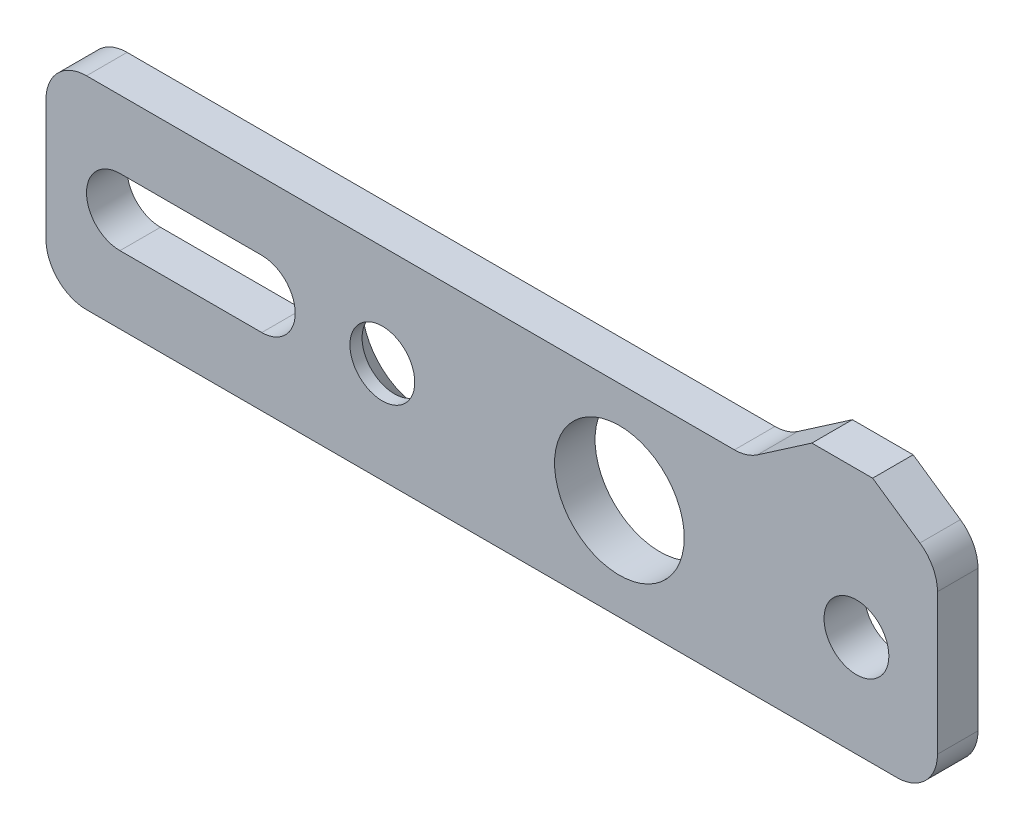
ISO-10303-21;
HEADER;
FILE_DESCRIPTION(('STEP AP214'),'2;1');
FILE_NAME('part.step','',(''),(''),'','','');
FILE_SCHEMA(('AUTOMOTIVE_DESIGN { 1 0 10303 214 1 1 1 1 }'));
ENDSEC;
DATA;
#1=APPLICATION_CONTEXT('core data for automotive mechanical design processes');
#2=APPLICATION_PROTOCOL_DEFINITION('international standard','automotive_design',2000,#1);
#3=PRODUCT_CONTEXT('',#1,'mechanical');
#4=PRODUCT('Part','Part','',(#3));
#5=PRODUCT_RELATED_PRODUCT_CATEGORY('part','',(#4));
#6=PRODUCT_DEFINITION_FORMATION('','',#4);
#7=PRODUCT_DEFINITION_CONTEXT('part definition',#1,'design');
#8=PRODUCT_DEFINITION('design','',#6,#7);
#9=PRODUCT_DEFINITION_SHAPE('','',#8);
#10=(LENGTH_UNIT() NAMED_UNIT(*) SI_UNIT(.MILLI.,.METRE.));
#11=(NAMED_UNIT(*) PLANE_ANGLE_UNIT() SI_UNIT($,.RADIAN.));
#12=(NAMED_UNIT(*) SI_UNIT($,.STERADIAN.) SOLID_ANGLE_UNIT());
#13=UNCERTAINTY_MEASURE_WITH_UNIT(LENGTH_MEASURE(1.E-05),#10,'distance_accuracy_value','');
#14=(GEOMETRIC_REPRESENTATION_CONTEXT(3) GLOBAL_UNCERTAINTY_ASSIGNED_CONTEXT((#13)) GLOBAL_UNIT_ASSIGNED_CONTEXT((#10,
#11,#12)) REPRESENTATION_CONTEXT('',''));
#15=CARTESIAN_POINT('',(0.,0.,0.));
#16=DIRECTION('',(0.,0.,1.));
#17=DIRECTION('',(1.,0.,0.));
#18=AXIS2_PLACEMENT_3D('',#15,#16,#17);
#19=CARTESIAN_POINT('',(62.9999999999999,25.,-10.));
#20=DIRECTION('',(0.,1.,0.));
#21=DIRECTION('',(-1.,0.,0.));
#22=AXIS2_PLACEMENT_3D('',#19,#20,#21);
#23=PLANE('',#22);
#24=DIRECTION('',(-1.,0.,0.));
#25=VECTOR('',#24,1.);
#26=CARTESIAN_POINT('',(62.9999999999999,25.,0.));
#27=LINE('',#26,#25);
#28=CARTESIAN_POINT('',(59.894101964593,25.,0.));
#29=VERTEX_POINT('',#28);
#30=CARTESIAN_POINT('',(-100.,25.,0.));
#31=VERTEX_POINT('',#30);
#32=EDGE_CURVE('E212',#29,#31,#27,.T.);
#33=ORIENTED_EDGE('',*,*,#32,.F.);
#34=DIRECTION('',(0.,0.,1.));
#35=VECTOR('',#34,1.);
#36=CARTESIAN_POINT('',(59.894101964593,25.,-10.));
#37=LINE('',#36,#35);
#38=CARTESIAN_POINT('',(59.894101964593,25.,-10.));
#39=VERTEX_POINT('',#38);
#40=EDGE_CURVE('E293',#29,#39,#37,.F.);
#41=ORIENTED_EDGE('',*,*,#40,.T.);
#42=DIRECTION('',(-1.,0.,0.));
#43=VECTOR('',#42,1.);
#44=CARTESIAN_POINT('',(62.9999999999999,25.,-10.));
#45=LINE('',#44,#43);
#46=CARTESIAN_POINT('',(-100.,25.,-10.));
#47=VERTEX_POINT('',#46);
#48=EDGE_CURVE('E218',#39,#47,#45,.T.);
#49=ORIENTED_EDGE('',*,*,#48,.T.);
#50=DIRECTION('',(0.,0.,1.));
#51=VECTOR('',#50,1.);
#52=CARTESIAN_POINT('',(-100.,25.,-10.));
#53=LINE('',#52,#51);
#54=EDGE_CURVE('E289',#47,#31,#53,.T.);
#55=ORIENTED_EDGE('',*,*,#54,.T.);
#56=EDGE_LOOP('',(#33,#41,#49,#55));
#57=FACE_BOUND('',#56,.T.);
#58=ADVANCED_FACE('F44',(#57),#23,.T.);
#59=CARTESIAN_POINT('',(78.9999999999999,36.0000000000001,-10.));
#60=DIRECTION('',(-0.566528822887066,0.824041924199367,0.));
#61=DIRECTION('',(-0.824041924199367,-0.566528822887066,0.));
#62=AXIS2_PLACEMENT_3D('',#59,#60,#61);
#63=PLANE('',#62);
#64=DIRECTION('',(-0.824041924199367,-0.566528822887066,0.));
#65=VECTOR('',#64,1.);
#66=CARTESIAN_POINT('',(78.9999999999999,36.0000000000001,-10.));
#67=LINE('',#66,#65);
#68=CARTESIAN_POINT('',(78.9999999999999,36.0000000000001,-10.));
#69=VERTEX_POINT('',#68);
#70=CARTESIAN_POINT('',(65.5593901934637,26.7595807580064,-10.));
#71=VERTEX_POINT('',#70);
#72=EDGE_CURVE('E241',#69,#71,#67,.T.);
#73=ORIENTED_EDGE('',*,*,#72,.T.);
#74=DIRECTION('',(0.,0.,1.));
#75=VECTOR('',#74,1.);
#76=CARTESIAN_POINT('',(65.5593901934637,26.7595807580064,0.));
#77=LINE('',#76,#75);
#78=CARTESIAN_POINT('',(65.5593901934637,26.7595807580064,0.));
#79=VERTEX_POINT('',#78);
#80=EDGE_CURVE('E285',#71,#79,#77,.T.);
#81=ORIENTED_EDGE('',*,*,#80,.T.);
#82=DIRECTION('',(-0.824041924199367,-0.566528822887066,0.));
#83=VECTOR('',#82,1.);
#84=CARTESIAN_POINT('',(78.9999999999999,36.0000000000001,0.));
#85=LINE('',#84,#83);
#86=CARTESIAN_POINT('',(78.9999999999999,36.0000000000001,0.));
#87=VERTEX_POINT('',#86);
#88=EDGE_CURVE('E223',#87,#79,#85,.T.);
#89=ORIENTED_EDGE('',*,*,#88,.F.);
#90=DIRECTION('',(0.,0.,1.));
#91=VECTOR('',#90,1.);
#92=CARTESIAN_POINT('',(78.9999999999999,36.0000000000001,-10.));
#93=LINE('',#92,#91);
#94=EDGE_CURVE('E271',#69,#87,#93,.T.);
#95=ORIENTED_EDGE('',*,*,#94,.F.);
#96=EDGE_LOOP('',(#73,#81,#89,#95));
#97=FACE_BOUND('',#96,.T.);
#98=ADVANCED_FACE('F360',(#97),#63,.T.);
#99=CARTESIAN_POINT('',(93.9999999999999,36.,-10.));
#100=DIRECTION('',(0.,1.,0.));
#101=DIRECTION('',(-1.,0.,0.));
#102=AXIS2_PLACEMENT_3D('',#99,#100,#101);
#103=PLANE('',#102);
#104=DIRECTION('',(-1.,0.,0.));
#105=VECTOR('',#104,1.);
#106=CARTESIAN_POINT('',(93.9999999999999,36.,0.));
#107=LINE('',#106,#105);
#108=CARTESIAN_POINT('',(93.9999999999999,36.,0.));
#109=VERTEX_POINT('',#108);
#110=EDGE_CURVE('E264',#109,#87,#107,.T.);
#111=ORIENTED_EDGE('',*,*,#110,.F.);
#112=DIRECTION('',(0.,0.,1.));
#113=VECTOR('',#112,1.);
#114=CARTESIAN_POINT('',(93.9999999999999,36.,-10.));
#115=LINE('',#114,#113);
#116=CARTESIAN_POINT('',(93.9999999999999,36.,-10.));
#117=VERTEX_POINT('',#116);
#118=EDGE_CURVE('E245',#117,#109,#115,.T.);
#119=ORIENTED_EDGE('',*,*,#118,.F.);
#120=DIRECTION('',(-1.,0.,0.));
#121=VECTOR('',#120,1.);
#122=CARTESIAN_POINT('',(93.9999999999999,36.,-10.));
#123=LINE('',#122,#121);
#124=EDGE_CURVE('E237',#117,#69,#123,.T.);
#125=ORIENTED_EDGE('',*,*,#124,.T.);
#126=ORIENTED_EDGE('',*,*,#94,.T.);
#127=EDGE_LOOP('',(#111,#119,#125,#126));
#128=FACE_BOUND('',#127,.T.);
#129=ADVANCED_FACE('F364',(#128),#103,.T.);
#130=CARTESIAN_POINT('',(110.,25.0000000000001,-10.));
#131=DIRECTION('',(0.566528822887065,0.824041924199368,0.));
#132=DIRECTION('',(-0.824041924199368,0.566528822887065,0.));
#133=AXIS2_PLACEMENT_3D('',#130,#131,#132);
#134=PLANE('',#133);
#135=DIRECTION('',(-0.824041924199368,0.566528822887065,0.));
#136=VECTOR('',#135,1.);
#137=CARTESIAN_POINT('',(110.,25.0000000000001,0.));
#138=LINE('',#137,#136);
#139=CARTESIAN_POINT('',(105.665288228871,27.9801143426515,0.));
#140=VERTEX_POINT('',#139);
#141=EDGE_CURVE('E261',#140,#109,#138,.T.);
#142=ORIENTED_EDGE('',*,*,#141,.F.);
#143=DIRECTION('',(0.,0.,1.));
#144=VECTOR('',#143,1.);
#145=CARTESIAN_POINT('',(105.665288228871,27.9801143426515,-10.));
#146=LINE('',#145,#144);
#147=CARTESIAN_POINT('',(105.665288228871,27.9801143426515,-10.));
#148=VERTEX_POINT('',#147);
#149=EDGE_CURVE('E315',#140,#148,#146,.F.);
#150=ORIENTED_EDGE('',*,*,#149,.T.);
#151=DIRECTION('',(-0.824041924199368,0.566528822887065,0.));
#152=VECTOR('',#151,1.);
#153=CARTESIAN_POINT('',(110.,25.0000000000001,-10.));
#154=LINE('',#153,#152);
#155=EDGE_CURVE('E234',#148,#117,#154,.T.);
#156=ORIENTED_EDGE('',*,*,#155,.T.);
#157=ORIENTED_EDGE('',*,*,#118,.T.);
#158=EDGE_LOOP('',(#142,#150,#156,#157));
#159=FACE_BOUND('',#158,.T.);
#160=ADVANCED_FACE('F584',(#159),#134,.T.);
#161=CARTESIAN_POINT('',(110.,-25.,-10.));
#162=DIRECTION('',(1.,0.,0.));
#163=DIRECTION('',(0.,1.,0.));
#164=AXIS2_PLACEMENT_3D('',#161,#162,#163);
#165=PLANE('',#164);
#166=DIRECTION('',(0.,1.,0.));
#167=VECTOR('',#166,1.);
#168=CARTESIAN_POINT('',(110.,-25.,-10.));
#169=LINE('',#168,#167);
#170=CARTESIAN_POINT('',(110.,-15.,-10.));
#171=VERTEX_POINT('',#170);
#172=CARTESIAN_POINT('',(110.,19.7396951006578,-10.));
#173=VERTEX_POINT('',#172);
#174=EDGE_CURVE('E230',#171,#173,#169,.T.);
#175=ORIENTED_EDGE('',*,*,#174,.T.);
#176=DIRECTION('',(0.,0.,1.));
#177=VECTOR('',#176,1.);
#178=CARTESIAN_POINT('',(110.,19.7396951006578,-10.));
#179=LINE('',#178,#177);
#180=CARTESIAN_POINT('',(110.,19.7396951006578,0.));
#181=VERTEX_POINT('',#180);
#182=EDGE_CURVE('E299',#173,#181,#179,.T.);
#183=ORIENTED_EDGE('',*,*,#182,.T.);
#184=DIRECTION('',(0.,1.,0.));
#185=VECTOR('',#184,1.);
#186=CARTESIAN_POINT('',(110.,-25.,0.));
#187=LINE('',#186,#185);
#188=CARTESIAN_POINT('',(110.,-15.,0.));
#189=VERTEX_POINT('',#188);
#190=EDGE_CURVE('E257',#189,#181,#187,.T.);
#191=ORIENTED_EDGE('',*,*,#190,.F.);
#192=DIRECTION('',(0.,0.,1.));
#193=VECTOR('',#192,1.);
#194=CARTESIAN_POINT('',(110.,-15.,-10.));
#195=LINE('',#194,#193);
#196=EDGE_CURVE('E296',#189,#171,#195,.F.);
#197=ORIENTED_EDGE('',*,*,#196,.T.);
#198=EDGE_LOOP('',(#175,#183,#191,#197));
#199=FACE_BOUND('',#198,.T.);
#200=ADVANCED_FACE('F374',(#199),#165,.T.);
#201=CARTESIAN_POINT('',(110.,-25.,-10.));
#202=DIRECTION('',(0.,-1.,0.));
#203=DIRECTION('',(1.,0.,0.));
#204=AXIS2_PLACEMENT_3D('',#201,#202,#203);
#205=PLANE('',#204);
#206=DIRECTION('',(1.,0.,0.));
#207=VECTOR('',#206,1.);
#208=CARTESIAN_POINT('',(110.,-25.,-10.));
#209=LINE('',#208,#207);
#210=CARTESIAN_POINT('',(-100.,-25.,-10.));
#211=VERTEX_POINT('',#210);
#212=CARTESIAN_POINT('',(99.9999999999999,-25.,-10.));
#213=VERTEX_POINT('',#212);
#214=EDGE_CURVE('E226',#211,#213,#209,.T.);
#215=ORIENTED_EDGE('',*,*,#214,.T.);
#216=DIRECTION('',(0.,0.,1.));
#217=VECTOR('',#216,1.);
#218=CARTESIAN_POINT('',(99.9999999999999,-25.,-10.));
#219=LINE('',#218,#217);
#220=CARTESIAN_POINT('',(99.9999999999999,-25.,0.));
#221=VERTEX_POINT('',#220);
#222=EDGE_CURVE('E332',#213,#221,#219,.T.);
#223=ORIENTED_EDGE('',*,*,#222,.T.);
#224=DIRECTION('',(1.,0.,0.));
#225=VECTOR('',#224,1.);
#226=CARTESIAN_POINT('',(110.,-25.,0.));
#227=LINE('',#226,#225);
#228=CARTESIAN_POINT('',(-100.,-25.,0.));
#229=VERTEX_POINT('',#228);
#230=EDGE_CURVE('E253',#229,#221,#227,.T.);
#231=ORIENTED_EDGE('',*,*,#230,.F.);
#232=DIRECTION('',(0.,0.,1.));
#233=VECTOR('',#232,1.);
#234=CARTESIAN_POINT('',(-100.,-25.,-10.));
#235=LINE('',#234,#233);
#236=EDGE_CURVE('E329',#229,#211,#235,.F.);
#237=ORIENTED_EDGE('',*,*,#236,.T.);
#238=EDGE_LOOP('',(#215,#223,#231,#237));
#239=FACE_BOUND('',#238,.T.);
#240=ADVANCED_FACE('F383',(#239),#205,.T.);
#241=CARTESIAN_POINT('',(-110.,-25.,-10.));
#242=DIRECTION('',(-1.,0.,0.));
#243=DIRECTION('',(0.,-1.,0.));
#244=AXIS2_PLACEMENT_3D('',#241,#242,#243);
#245=PLANE('',#244);
#246=DIRECTION('',(0.,-1.,0.));
#247=VECTOR('',#246,1.);
#248=CARTESIAN_POINT('',(-110.,-25.,-10.));
#249=LINE('',#248,#247);
#250=CARTESIAN_POINT('',(-110.,15.,-10.));
#251=VERTEX_POINT('',#250);
#252=CARTESIAN_POINT('',(-110.,-15.,-10.));
#253=VERTEX_POINT('',#252);
#254=EDGE_CURVE('E222',#251,#253,#249,.T.);
#255=ORIENTED_EDGE('',*,*,#254,.T.);
#256=DIRECTION('',(0.,0.,1.));
#257=VECTOR('',#256,1.);
#258=CARTESIAN_POINT('',(-110.,-15.,-10.));
#259=LINE('',#258,#257);
#260=CARTESIAN_POINT('',(-110.,-15.,0.));
#261=VERTEX_POINT('',#260);
#262=EDGE_CURVE('E338',#253,#261,#259,.T.);
#263=ORIENTED_EDGE('',*,*,#262,.T.);
#264=DIRECTION('',(0.,-1.,0.));
#265=VECTOR('',#264,1.);
#266=CARTESIAN_POINT('',(-110.,-25.,0.));
#267=LINE('',#266,#265);
#268=CARTESIAN_POINT('',(-110.,15.,0.));
#269=VERTEX_POINT('',#268);
#270=EDGE_CURVE('E249',#269,#261,#267,.T.);
#271=ORIENTED_EDGE('',*,*,#270,.F.);
#272=DIRECTION('',(0.,0.,1.));
#273=VECTOR('',#272,1.);
#274=CARTESIAN_POINT('',(-110.,15.,-10.));
#275=LINE('',#274,#273);
#276=EDGE_CURVE('E67',#269,#251,#275,.F.);
#277=ORIENTED_EDGE('',*,*,#276,.T.);
#278=EDGE_LOOP('',(#255,#263,#271,#277));
#279=FACE_BOUND('',#278,.T.);
#280=ADVANCED_FACE('F388',(#279),#245,.T.);
#281=CARTESIAN_POINT('',(0.,0.,-10.));
#282=DIRECTION('',(0.,0.,-1.));
#283=DIRECTION('',(-1.,0.,0.));
#284=AXIS2_PLACEMENT_3D('',#281,#282,#283);
#285=PLANE('',#284);
#286=CARTESIAN_POINT('',(-27.0000000000001,0.,-10.));
#287=DIRECTION('',(0.,0.,-1.));
#288=DIRECTION('',(-1.,0.,0.));
#289=AXIS2_PLACEMENT_3D('',#286,#287,#288);
#290=CIRCLE('',#289,15.);
#291=CARTESIAN_POINT('',(-42.0000000000002,0.,-10.));
#292=VERTEX_POINT('',#291);
#293=EDGE_CURVE('E274',#292,#292,#290,.F.);
#294=ORIENTED_EDGE('',*,*,#293,.T.);
#295=EDGE_LOOP('',(#294));
#296=FACE_BOUND('',#295,.T.);
#297=CARTESIAN_POINT('',(31.4999999999999,0.,-10.));
#298=DIRECTION('',(0.,0.,1.));
#299=DIRECTION('',(1.,0.,0.));
#300=AXIS2_PLACEMENT_3D('',#297,#298,#299);
#301=CIRCLE('',#300,16.);
#302=CARTESIAN_POINT('',(47.4999999999999,0.,-10.));
#303=VERTEX_POINT('',#302);
#304=EDGE_CURVE('E658',#303,#303,#301,.T.);
#305=ORIENTED_EDGE('',*,*,#304,.T.);
#306=EDGE_LOOP('',(#305));
#307=FACE_BOUND('',#306,.T.);
#308=CARTESIAN_POINT('',(89.9999999999999,0.,-10.));
#309=DIRECTION('',(0.,0.,1.));
#310=DIRECTION('',(1.,0.,0.));
#311=AXIS2_PLACEMENT_3D('',#308,#309,#310);
#312=CIRCLE('',#311,7.99999999999999);
#313=CARTESIAN_POINT('',(97.9999999999999,0.,-10.));
#314=VERTEX_POINT('',#313);
#315=EDGE_CURVE('E194',#314,#314,#312,.T.);
#316=ORIENTED_EDGE('',*,*,#315,.T.);
#317=EDGE_LOOP('',(#316));
#318=FACE_BOUND('',#317,.T.);
#319=CARTESIAN_POINT('',(-91.75,0.,-10.));
#320=DIRECTION('',(0.,0.,1.));
#321=DIRECTION('',(1.,0.,0.));
#322=AXIS2_PLACEMENT_3D('',#319,#320,#321);
#323=CIRCLE('',#322,8.25);
#324=CARTESIAN_POINT('',(-91.75,8.25,-10.));
#325=VERTEX_POINT('',#324);
#326=CARTESIAN_POINT('',(-91.75,-8.25,-10.));
#327=VERTEX_POINT('',#326);
#328=EDGE_CURVE('E163',#325,#327,#323,.T.);
#329=ORIENTED_EDGE('',*,*,#328,.T.);
#330=DIRECTION('',(1.,0.,0.));
#331=VECTOR('',#330,1.);
#332=CARTESIAN_POINT('',(-91.75,-8.25,-10.));
#333=LINE('',#332,#331);
#334=CARTESIAN_POINT('',(-56.75,-8.25,-10.));
#335=VERTEX_POINT('',#334);
#336=EDGE_CURVE('E176',#327,#335,#333,.T.);
#337=ORIENTED_EDGE('',*,*,#336,.T.);
#338=CARTESIAN_POINT('',(-56.75,0.,-10.));
#339=DIRECTION('',(0.,0.,1.));
#340=DIRECTION('',(1.,0.,0.));
#341=AXIS2_PLACEMENT_3D('',#338,#339,#340);
#342=CIRCLE('',#341,8.25);
#343=CARTESIAN_POINT('',(-56.75,8.25,-10.));
#344=VERTEX_POINT('',#343);
#345=EDGE_CURVE('E181',#335,#344,#342,.T.);
#346=ORIENTED_EDGE('',*,*,#345,.T.);
#347=DIRECTION('',(-1.,0.,0.));
#348=VECTOR('',#347,1.);
#349=CARTESIAN_POINT('',(-91.75,8.25,-10.));
#350=LINE('',#349,#348);
#351=EDGE_CURVE('E172',#344,#325,#350,.T.);
#352=ORIENTED_EDGE('',*,*,#351,.T.);
#353=EDGE_LOOP('',(#329,#337,#346,#352));
#354=FACE_BOUND('',#353,.T.);
#355=ORIENTED_EDGE('',*,*,#155,.F.);
#356=CARTESIAN_POINT('',(99.9999999999999,19.7396951006578,-10.));
#357=DIRECTION('',(0.,0.,-1.));
#358=DIRECTION('',(-1.,0.,0.));
#359=AXIS2_PLACEMENT_3D('',#356,#357,#358);
#360=CIRCLE('',#359,10.);
#361=EDGE_CURVE('E326',#148,#173,#360,.T.);
#362=ORIENTED_EDGE('',*,*,#361,.T.);
#363=ORIENTED_EDGE('',*,*,#174,.F.);
#364=CARTESIAN_POINT('',(99.9999999999999,-15.,-10.));
#365=DIRECTION('',(0.,0.,-1.));
#366=DIRECTION('',(-1.,0.,0.));
#367=AXIS2_PLACEMENT_3D('',#364,#365,#366);
#368=CIRCLE('',#367,10.);
#369=EDGE_CURVE('E323',#171,#213,#368,.T.);
#370=ORIENTED_EDGE('',*,*,#369,.T.);
#371=ORIENTED_EDGE('',*,*,#214,.F.);
#372=CARTESIAN_POINT('',(-100.,-15.,-10.));
#373=DIRECTION('',(0.,0.,-1.));
#374=DIRECTION('',(-1.,0.,0.));
#375=AXIS2_PLACEMENT_3D('',#372,#373,#374);
#376=CIRCLE('',#375,10.);
#377=EDGE_CURVE('E60',#211,#253,#376,.T.);
#378=ORIENTED_EDGE('',*,*,#377,.T.);
#379=ORIENTED_EDGE('',*,*,#254,.F.);
#380=CARTESIAN_POINT('',(-100.,15.,-10.));
#381=DIRECTION('',(0.,0.,-1.));
#382=DIRECTION('',(-1.,0.,0.));
#383=AXIS2_PLACEMENT_3D('',#380,#381,#382);
#384=CIRCLE('',#383,10.);
#385=EDGE_CURVE('E318',#251,#47,#384,.T.);
#386=ORIENTED_EDGE('',*,*,#385,.T.);
#387=ORIENTED_EDGE('',*,*,#48,.F.);
#388=CARTESIAN_POINT('',(59.894101964593,35.,-10.));
#389=DIRECTION('',(0.,0.,-1.));
#390=DIRECTION('',(-1.,0.,0.));
#391=AXIS2_PLACEMENT_3D('',#388,#389,#390);
#392=CIRCLE('',#391,10.);
#393=EDGE_CURVE('E11',#39,#71,#392,.F.);
#394=ORIENTED_EDGE('',*,*,#393,.T.);
#395=ORIENTED_EDGE('',*,*,#72,.F.);
#396=ORIENTED_EDGE('',*,*,#124,.F.);
#397=EDGE_LOOP('',(#355,#362,#363,#370,#371,#378,#379,#386,#387,#394,#395,#396));
#398=FACE_BOUND('',#397,.T.);
#399=ADVANCED_FACE('F183',(#296,#307,#318,#354,#398),#285,.T.);
#400=CARTESIAN_POINT('',(0.,0.,0.));
#401=DIRECTION('',(0.,0.,-1.));
#402=DIRECTION('',(-1.,0.,0.));
#403=AXIS2_PLACEMENT_3D('',#400,#401,#402);
#404=PLANE('',#403);
#405=CARTESIAN_POINT('',(31.4999999999999,0.,0.));
#406=DIRECTION('',(0.,0.,1.));
#407=DIRECTION('',(1.,0.,0.));
#408=AXIS2_PLACEMENT_3D('',#405,#406,#407);
#409=CIRCLE('',#408,16.);
#410=CARTESIAN_POINT('',(47.4999999999999,0.,0.));
#411=VERTEX_POINT('',#410);
#412=EDGE_CURVE('E675',#411,#411,#409,.T.);
#413=ORIENTED_EDGE('',*,*,#412,.F.);
#414=EDGE_LOOP('',(#413));
#415=FACE_BOUND('',#414,.T.);
#416=CARTESIAN_POINT('',(-27.0000000000001,0.,0.));
#417=DIRECTION('',(0.,0.,1.));
#418=DIRECTION('',(1.,0.,0.));
#419=AXIS2_PLACEMENT_3D('',#416,#417,#418);
#420=CIRCLE('',#419,8.);
#421=CARTESIAN_POINT('',(-19.0000000000001,0.,0.));
#422=VERTEX_POINT('',#421);
#423=EDGE_CURVE('E665',#422,#422,#420,.T.);
#424=ORIENTED_EDGE('',*,*,#423,.F.);
#425=EDGE_LOOP('',(#424));
#426=FACE_BOUND('',#425,.T.);
#427=CARTESIAN_POINT('',(89.9999999999999,0.,0.));
#428=DIRECTION('',(0.,0.,1.));
#429=DIRECTION('',(1.,0.,0.));
#430=AXIS2_PLACEMENT_3D('',#427,#428,#429);
#431=CIRCLE('',#430,7.99999999999999);
#432=CARTESIAN_POINT('',(97.9999999999999,0.,0.));
#433=VERTEX_POINT('',#432);
#434=EDGE_CURVE('E661',#433,#433,#431,.T.);
#435=ORIENTED_EDGE('',*,*,#434,.F.);
#436=EDGE_LOOP('',(#435));
#437=FACE_BOUND('',#436,.T.);
#438=DIRECTION('',(1.,0.,0.));
#439=VECTOR('',#438,1.);
#440=CARTESIAN_POINT('',(-91.75,-8.25,0.));
#441=LINE('',#440,#439);
#442=CARTESIAN_POINT('',(-91.75,-8.25,0.));
#443=VERTEX_POINT('',#442);
#444=CARTESIAN_POINT('',(-56.75,-8.25,0.));
#445=VERTEX_POINT('',#444);
#446=EDGE_CURVE('E203',#443,#445,#441,.T.);
#447=ORIENTED_EDGE('',*,*,#446,.F.);
#448=CARTESIAN_POINT('',(-91.75,0.,0.));
#449=DIRECTION('',(0.,0.,1.));
#450=DIRECTION('',(1.,0.,0.));
#451=AXIS2_PLACEMENT_3D('',#448,#449,#450);
#452=CIRCLE('',#451,8.25);
#453=CARTESIAN_POINT('',(-91.75,8.25,0.));
#454=VERTEX_POINT('',#453);
#455=EDGE_CURVE('E166',#454,#443,#452,.T.);
#456=ORIENTED_EDGE('',*,*,#455,.F.);
#457=DIRECTION('',(-1.,0.,0.));
#458=VECTOR('',#457,1.);
#459=CARTESIAN_POINT('',(-91.75,8.25,0.));
#460=LINE('',#459,#458);
#461=CARTESIAN_POINT('',(-56.75,8.25,0.));
#462=VERTEX_POINT('',#461);
#463=EDGE_CURVE('E186',#462,#454,#460,.T.);
#464=ORIENTED_EDGE('',*,*,#463,.F.);
#465=CARTESIAN_POINT('',(-56.75,0.,0.));
#466=DIRECTION('',(0.,0.,1.));
#467=DIRECTION('',(1.,0.,0.));
#468=AXIS2_PLACEMENT_3D('',#465,#466,#467);
#469=CIRCLE('',#468,8.25);
#470=EDGE_CURVE('E191',#445,#462,#469,.T.);
#471=ORIENTED_EDGE('',*,*,#470,.F.);
#472=EDGE_LOOP('',(#447,#456,#464,#471));
#473=FACE_BOUND('',#472,.T.);
#474=ORIENTED_EDGE('',*,*,#190,.T.);
#475=CARTESIAN_POINT('',(99.9999999999999,19.7396951006578,0.));
#476=DIRECTION('',(0.,0.,-1.));
#477=DIRECTION('',(-1.,0.,0.));
#478=AXIS2_PLACEMENT_3D('',#475,#476,#477);
#479=CIRCLE('',#478,10.);
#480=EDGE_CURVE('E312',#181,#140,#479,.F.);
#481=ORIENTED_EDGE('',*,*,#480,.T.);
#482=ORIENTED_EDGE('',*,*,#141,.T.);
#483=ORIENTED_EDGE('',*,*,#110,.T.);
#484=ORIENTED_EDGE('',*,*,#88,.T.);
#485=CARTESIAN_POINT('',(59.894101964593,35.,0.));
#486=DIRECTION('',(0.,0.,-1.));
#487=DIRECTION('',(-1.,0.,0.));
#488=AXIS2_PLACEMENT_3D('',#485,#486,#487);
#489=CIRCLE('',#488,10.);
#490=EDGE_CURVE('E53',#79,#29,#489,.T.);
#491=ORIENTED_EDGE('',*,*,#490,.T.);
#492=ORIENTED_EDGE('',*,*,#32,.T.);
#493=CARTESIAN_POINT('',(-100.,15.,0.));
#494=DIRECTION('',(0.,0.,-1.));
#495=DIRECTION('',(-1.,0.,0.));
#496=AXIS2_PLACEMENT_3D('',#493,#494,#495);
#497=CIRCLE('',#496,10.);
#498=EDGE_CURVE('E303',#31,#269,#497,.F.);
#499=ORIENTED_EDGE('',*,*,#498,.T.);
#500=ORIENTED_EDGE('',*,*,#270,.T.);
#501=CARTESIAN_POINT('',(-100.,-15.,0.));
#502=DIRECTION('',(0.,0.,-1.));
#503=DIRECTION('',(-1.,0.,0.));
#504=AXIS2_PLACEMENT_3D('',#501,#502,#503);
#505=CIRCLE('',#504,10.);
#506=EDGE_CURVE('E306',#261,#229,#505,.F.);
#507=ORIENTED_EDGE('',*,*,#506,.T.);
#508=ORIENTED_EDGE('',*,*,#230,.T.);
#509=CARTESIAN_POINT('',(99.9999999999999,-15.,0.));
#510=DIRECTION('',(0.,0.,-1.));
#511=DIRECTION('',(-1.,0.,0.));
#512=AXIS2_PLACEMENT_3D('',#509,#510,#511);
#513=CIRCLE('',#512,10.);
#514=EDGE_CURVE('E309',#221,#189,#513,.F.);
#515=ORIENTED_EDGE('',*,*,#514,.T.);
#516=EDGE_LOOP('',(#474,#481,#482,#483,#484,#491,#492,#499,#500,#507,#508,#515));
#517=FACE_BOUND('',#516,.T.);
#518=ADVANCED_FACE('F346',(#415,#426,#437,#473,#517),#404,.F.);
#519=CARTESIAN_POINT('',(-91.75,0.,-10.));
#520=DIRECTION('',(0.,0.,1.));
#521=DIRECTION('',(1.,0.,0.));
#522=AXIS2_PLACEMENT_3D('',#519,#520,#521);
#523=CYLINDRICAL_SURFACE('',#522,8.25);
#524=ORIENTED_EDGE('',*,*,#455,.T.);
#525=DIRECTION('',(0.,0.,1.));
#526=VECTOR('',#525,1.);
#527=CARTESIAN_POINT('',(-91.75,-8.25,-10.));
#528=LINE('',#527,#526);
#529=EDGE_CURVE('E159',#327,#443,#528,.T.);
#530=ORIENTED_EDGE('',*,*,#529,.F.);
#531=ORIENTED_EDGE('',*,*,#328,.F.);
#532=DIRECTION('',(0.,0.,1.));
#533=VECTOR('',#532,1.);
#534=CARTESIAN_POINT('',(-91.75,8.25,-10.));
#535=LINE('',#534,#533);
#536=EDGE_CURVE('E209',#325,#454,#535,.T.);
#537=ORIENTED_EDGE('',*,*,#536,.T.);
#538=EDGE_LOOP('',(#524,#530,#531,#537));
#539=FACE_BOUND('',#538,.T.);
#540=ADVANCED_FACE('F161',(#539),#523,.F.);
#541=CARTESIAN_POINT('',(-91.75,8.25,-10.));
#542=DIRECTION('',(0.,1.,0.));
#543=DIRECTION('',(0.,0.,1.));
#544=AXIS2_PLACEMENT_3D('',#541,#542,#543);
#545=PLANE('',#544);
#546=ORIENTED_EDGE('',*,*,#463,.T.);
#547=ORIENTED_EDGE('',*,*,#536,.F.);
#548=ORIENTED_EDGE('',*,*,#351,.F.);
#549=DIRECTION('',(0.,0.,1.));
#550=VECTOR('',#549,1.);
#551=CARTESIAN_POINT('',(-56.75,8.25,-10.));
#552=LINE('',#551,#550);
#553=EDGE_CURVE('E213',#344,#462,#552,.T.);
#554=ORIENTED_EDGE('',*,*,#553,.T.);
#555=EDGE_LOOP('',(#546,#547,#548,#554));
#556=FACE_BOUND('',#555,.T.);
#557=ADVANCED_FACE('F518',(#556),#545,.F.);
#558=CARTESIAN_POINT('',(-56.75,0.,-10.));
#559=DIRECTION('',(0.,0.,1.));
#560=DIRECTION('',(1.,0.,0.));
#561=AXIS2_PLACEMENT_3D('',#558,#559,#560);
#562=CYLINDRICAL_SURFACE('',#561,8.25);
#563=ORIENTED_EDGE('',*,*,#470,.T.);
#564=ORIENTED_EDGE('',*,*,#553,.F.);
#565=ORIENTED_EDGE('',*,*,#345,.F.);
#566=DIRECTION('',(0.,0.,1.));
#567=VECTOR('',#566,1.);
#568=CARTESIAN_POINT('',(-56.75,-8.25,-10.));
#569=LINE('',#568,#567);
#570=EDGE_CURVE('E171',#335,#445,#569,.T.);
#571=ORIENTED_EDGE('',*,*,#570,.T.);
#572=EDGE_LOOP('',(#563,#564,#565,#571));
#573=FACE_BOUND('',#572,.T.);
#574=ADVANCED_FACE('F509',(#573),#562,.F.);
#575=CARTESIAN_POINT('',(-91.75,-8.25,-10.));
#576=DIRECTION('',(0.,-1.,0.));
#577=DIRECTION('',(0.,0.,-1.));
#578=AXIS2_PLACEMENT_3D('',#575,#576,#577);
#579=PLANE('',#578);
#580=ORIENTED_EDGE('',*,*,#446,.T.);
#581=ORIENTED_EDGE('',*,*,#570,.F.);
#582=ORIENTED_EDGE('',*,*,#336,.F.);
#583=ORIENTED_EDGE('',*,*,#529,.T.);
#584=EDGE_LOOP('',(#580,#581,#582,#583));
#585=FACE_BOUND('',#584,.T.);
#586=ADVANCED_FACE('F177',(#585),#579,.F.);
#587=CARTESIAN_POINT('',(89.9999999999999,0.,0.));
#588=DIRECTION('',(0.,0.,1.));
#589=DIRECTION('',(1.,0.,0.));
#590=AXIS2_PLACEMENT_3D('',#587,#588,#589);
#591=CYLINDRICAL_SURFACE('',#590,7.99999999999999);
#592=ORIENTED_EDGE('',*,*,#315,.F.);
#593=EDGE_LOOP('',(#592));
#594=FACE_BOUND('',#593,.T.);
#595=ORIENTED_EDGE('',*,*,#434,.T.);
#596=EDGE_LOOP('',(#595));
#597=FACE_BOUND('',#596,.T.);
#598=ADVANCED_FACE('F487',(#594,#597),#591,.F.);
#599=CARTESIAN_POINT('',(-27.0000000000001,0.,0.));
#600=DIRECTION('',(0.,0.,1.));
#601=DIRECTION('',(1.,0.,0.));
#602=AXIS2_PLACEMENT_3D('',#599,#600,#601);
#603=CYLINDRICAL_SURFACE('',#602,8.);
#604=CARTESIAN_POINT('',(-27.0000000000001,0.,-2.99999999999994));
#605=DIRECTION('',(0.,0.,-1.));
#606=DIRECTION('',(-1.,0.,0.));
#607=AXIS2_PLACEMENT_3D('',#604,#605,#606);
#608=CIRCLE('',#607,8.);
#609=CARTESIAN_POINT('',(-35.0000000000001,0.,-2.99999999999994));
#610=VERTEX_POINT('',#609);
#611=EDGE_CURVE('E281',#610,#610,#608,.T.);
#612=ORIENTED_EDGE('',*,*,#611,.T.);
#613=EDGE_LOOP('',(#612));
#614=FACE_BOUND('',#613,.T.);
#615=ORIENTED_EDGE('',*,*,#423,.T.);
#616=EDGE_LOOP('',(#615));
#617=FACE_BOUND('',#616,.T.);
#618=ADVANCED_FACE('F476',(#614,#617),#603,.F.);
#619=CARTESIAN_POINT('',(31.4999999999999,0.,0.));
#620=DIRECTION('',(0.,0.,1.));
#621=DIRECTION('',(1.,0.,0.));
#622=AXIS2_PLACEMENT_3D('',#619,#620,#621);
#623=CYLINDRICAL_SURFACE('',#622,16.);
#624=ORIENTED_EDGE('',*,*,#304,.F.);
#625=EDGE_LOOP('',(#624));
#626=FACE_BOUND('',#625,.T.);
#627=ORIENTED_EDGE('',*,*,#412,.T.);
#628=EDGE_LOOP('',(#627));
#629=FACE_BOUND('',#628,.T.);
#630=ADVANCED_FACE('F412',(#626,#629),#623,.F.);
#631=CARTESIAN_POINT('',(-27.0000000000001,0.,-10.));
#632=DIRECTION('',(0.,0.,-1.));
#633=DIRECTION('',(-1.,0.,0.));
#634=AXIS2_PLACEMENT_3D('',#631,#632,#633);
#635=CONICAL_SURFACE('',#634,15.,0.785398163397447);
#636=ORIENTED_EDGE('',*,*,#611,.F.);
#637=EDGE_LOOP('',(#636));
#638=FACE_BOUND('',#637,.T.);
#639=ORIENTED_EDGE('',*,*,#293,.F.);
#640=EDGE_LOOP('',(#639));
#641=FACE_BOUND('',#640,.T.);
#642=ADVANCED_FACE('F407',(#638,#641),#635,.F.);
#643=CARTESIAN_POINT('',(59.894101964593,35.,-10.));
#644=DIRECTION('',(0.,0.,-1.));
#645=DIRECTION('',(-1.,0.,0.));
#646=AXIS2_PLACEMENT_3D('',#643,#644,#645);
#647=CYLINDRICAL_SURFACE('',#646,10.);
#648=ORIENTED_EDGE('',*,*,#393,.F.);
#649=ORIENTED_EDGE('',*,*,#40,.F.);
#650=ORIENTED_EDGE('',*,*,#490,.F.);
#651=ORIENTED_EDGE('',*,*,#80,.F.);
#652=EDGE_LOOP('',(#648,#649,#650,#651));
#653=FACE_BOUND('',#652,.T.);
#654=ADVANCED_FACE('F355',(#653),#647,.F.);
#655=CARTESIAN_POINT('',(99.9999999999999,19.7396951006578,-10.));
#656=DIRECTION('',(0.,0.,1.));
#657=DIRECTION('',(1.,0.,0.));
#658=AXIS2_PLACEMENT_3D('',#655,#656,#657);
#659=CYLINDRICAL_SURFACE('',#658,10.);
#660=ORIENTED_EDGE('',*,*,#361,.F.);
#661=ORIENTED_EDGE('',*,*,#149,.F.);
#662=ORIENTED_EDGE('',*,*,#480,.F.);
#663=ORIENTED_EDGE('',*,*,#182,.F.);
#664=EDGE_LOOP('',(#660,#661,#662,#663));
#665=FACE_BOUND('',#664,.T.);
#666=ADVANCED_FACE('F371',(#665),#659,.T.);
#667=CARTESIAN_POINT('',(99.9999999999999,-15.,-10.));
#668=DIRECTION('',(0.,0.,1.));
#669=DIRECTION('',(1.,0.,0.));
#670=AXIS2_PLACEMENT_3D('',#667,#668,#669);
#671=CYLINDRICAL_SURFACE('',#670,10.);
#672=ORIENTED_EDGE('',*,*,#369,.F.);
#673=ORIENTED_EDGE('',*,*,#196,.F.);
#674=ORIENTED_EDGE('',*,*,#514,.F.);
#675=ORIENTED_EDGE('',*,*,#222,.F.);
#676=EDGE_LOOP('',(#672,#673,#674,#675));
#677=FACE_BOUND('',#676,.T.);
#678=ADVANCED_FACE('F381',(#677),#671,.T.);
#679=CARTESIAN_POINT('',(-100.,-15.,-10.));
#680=DIRECTION('',(0.,0.,1.));
#681=DIRECTION('',(1.,0.,0.));
#682=AXIS2_PLACEMENT_3D('',#679,#680,#681);
#683=CYLINDRICAL_SURFACE('',#682,10.);
#684=ORIENTED_EDGE('',*,*,#377,.F.);
#685=ORIENTED_EDGE('',*,*,#236,.F.);
#686=ORIENTED_EDGE('',*,*,#506,.F.);
#687=ORIENTED_EDGE('',*,*,#262,.F.);
#688=EDGE_LOOP('',(#684,#685,#686,#687));
#689=FACE_BOUND('',#688,.T.);
#690=ADVANCED_FACE('F387',(#689),#683,.T.);
#691=CARTESIAN_POINT('',(-100.,15.,-10.));
#692=DIRECTION('',(0.,0.,1.));
#693=DIRECTION('',(1.,0.,0.));
#694=AXIS2_PLACEMENT_3D('',#691,#692,#693);
#695=CYLINDRICAL_SURFACE('',#694,10.);
#696=ORIENTED_EDGE('',*,*,#385,.F.);
#697=ORIENTED_EDGE('',*,*,#276,.F.);
#698=ORIENTED_EDGE('',*,*,#498,.F.);
#699=ORIENTED_EDGE('',*,*,#54,.F.);
#700=EDGE_LOOP('',(#696,#697,#698,#699));
#701=FACE_BOUND('',#700,.T.);
#702=ADVANCED_FACE('F46',(#701),#695,.T.);
#703=CLOSED_SHELL('',(#58,#98,#129,#160,#200,#240,#280,#399,#518,#540,#557,#574,#586,#598,#618,
#630,#642,#654,#666,#678,#690,#702));
#704=MANIFOLD_SOLID_BREP('B2',#703);
#705=ADVANCED_BREP_SHAPE_REPRESENTATION('',(#18,#704),#14);
#706=SHAPE_DEFINITION_REPRESENTATION(#9,#705);
ENDSEC;
END-ISO-10303-21;
